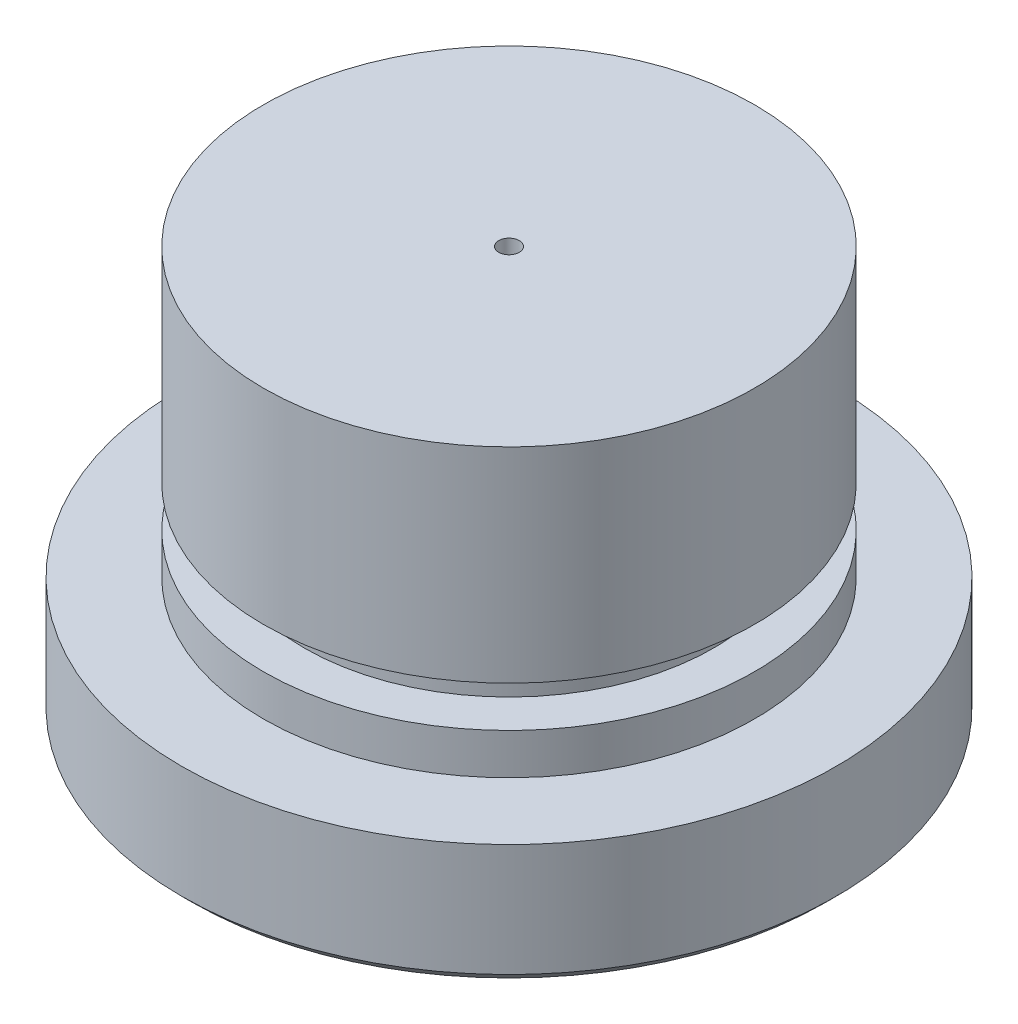
ISO-10303-21;
HEADER;
FILE_DESCRIPTION(('STEP AP214'),'2;1');
FILE_NAME('part.step','',(''),(''),'','','');
FILE_SCHEMA(('AUTOMOTIVE_DESIGN { 1 0 10303 214 1 1 1 1 }'));
ENDSEC;
DATA;
#1=APPLICATION_CONTEXT('core data for automotive mechanical design processes');
#2=APPLICATION_PROTOCOL_DEFINITION('international standard','automotive_design',2000,#1);
#3=PRODUCT_CONTEXT('',#1,'mechanical');
#4=PRODUCT('Part','Part','',(#3));
#5=PRODUCT_RELATED_PRODUCT_CATEGORY('part','',(#4));
#6=PRODUCT_DEFINITION_FORMATION('','',#4);
#7=PRODUCT_DEFINITION_CONTEXT('part definition',#1,'design');
#8=PRODUCT_DEFINITION('design','',#6,#7);
#9=PRODUCT_DEFINITION_SHAPE('','',#8);
#10=(LENGTH_UNIT() NAMED_UNIT(*) SI_UNIT(.MILLI.,.METRE.));
#11=(NAMED_UNIT(*) PLANE_ANGLE_UNIT() SI_UNIT($,.RADIAN.));
#12=(NAMED_UNIT(*) SI_UNIT($,.STERADIAN.) SOLID_ANGLE_UNIT());
#13=UNCERTAINTY_MEASURE_WITH_UNIT(LENGTH_MEASURE(1.E-05),#10,'distance_accuracy_value','');
#14=(GEOMETRIC_REPRESENTATION_CONTEXT(3) GLOBAL_UNCERTAINTY_ASSIGNED_CONTEXT((#13)) GLOBAL_UNIT_ASSIGNED_CONTEXT((#10,
#11,#12)) REPRESENTATION_CONTEXT('',''));
#15=CARTESIAN_POINT('',(0.,0.,0.));
#16=DIRECTION('',(0.,0.,1.));
#17=DIRECTION('',(1.,0.,0.));
#18=AXIS2_PLACEMENT_3D('',#15,#16,#17);
#19=CARTESIAN_POINT('',(0.,4.7625,0.));
#20=DIRECTION('',(0.,1.,0.));
#21=DIRECTION('',(0.,0.,1.));
#22=AXIS2_PLACEMENT_3D('',#19,#20,#21);
#23=CYLINDRICAL_SURFACE('',#22,9.525);
#24=CARTESIAN_POINT('',(0.,4.7625,0.));
#25=DIRECTION('',(0.,1.,0.));
#26=DIRECTION('',(0.,0.,1.));
#27=AXIS2_PLACEMENT_3D('',#24,#25,#26);
#28=CIRCLE('',#27,9.525);
#29=CARTESIAN_POINT('',(0.,4.7625,9.525));
#30=VERTEX_POINT('',#29);
#31=EDGE_CURVE('E45',#30,#30,#28,.T.);
#32=ORIENTED_EDGE('',*,*,#31,.T.);
#33=EDGE_LOOP('',(#32));
#34=FACE_BOUND('',#33,.T.);
#35=CARTESIAN_POINT('',(0.,6.35,0.));
#36=DIRECTION('',(0.,1.,0.));
#37=DIRECTION('',(0.,0.,1.));
#38=AXIS2_PLACEMENT_3D('',#35,#36,#37);
#39=CIRCLE('',#38,9.525);
#40=CARTESIAN_POINT('',(0.,6.35,9.525));
#41=VERTEX_POINT('',#40);
#42=EDGE_CURVE('E60',#41,#41,#39,.T.);
#43=ORIENTED_EDGE('',*,*,#42,.F.);
#44=EDGE_LOOP('',(#43));
#45=FACE_BOUND('',#44,.T.);
#46=ADVANCED_FACE('F30',(#34,#45),#23,.T.);
#47=CARTESIAN_POINT('',(0.,15.875,0.));
#48=DIRECTION('',(0.,-1.,0.));
#49=DIRECTION('',(0.,0.,-1.));
#50=AXIS2_PLACEMENT_3D('',#47,#48,#49);
#51=CYLINDRICAL_SURFACE('',#50,12.7);
#52=CARTESIAN_POINT('',(0.,0.396874999999998,0.));
#53=DIRECTION('',(0.,1.,0.));
#54=DIRECTION('',(0.,0.,1.));
#55=AXIS2_PLACEMENT_3D('',#52,#53,#54);
#56=CIRCLE('',#55,12.7);
#57=CARTESIAN_POINT('',(0.,0.396874999999998,12.7));
#58=VERTEX_POINT('',#57);
#59=EDGE_CURVE('E37',#58,#58,#56,.T.);
#60=ORIENTED_EDGE('',*,*,#59,.T.);
#61=EDGE_LOOP('',(#60));
#62=FACE_BOUND('',#61,.T.);
#63=CARTESIAN_POINT('',(0.,4.7625,0.));
#64=DIRECTION('',(0.,1.,0.));
#65=DIRECTION('',(0.,0.,1.));
#66=AXIS2_PLACEMENT_3D('',#63,#64,#65);
#67=CIRCLE('',#66,12.7);
#68=CARTESIAN_POINT('',(0.,4.7625,12.7));
#69=VERTEX_POINT('',#68);
#70=EDGE_CURVE('E41',#69,#69,#67,.T.);
#71=ORIENTED_EDGE('',*,*,#70,.F.);
#72=EDGE_LOOP('',(#71));
#73=FACE_BOUND('',#72,.T.);
#74=ADVANCED_FACE('F88',(#62,#73),#51,.T.);
#75=CARTESIAN_POINT('',(0.,0.,0.));
#76=DIRECTION('',(0.,1.,0.));
#77=DIRECTION('',(0.,0.,1.));
#78=AXIS2_PLACEMENT_3D('',#75,#76,#77);
#79=PLANE('',#78);
#80=CARTESIAN_POINT('',(0.,0.,0.));
#81=DIRECTION('',(0.,1.,0.));
#82=DIRECTION('',(0.,0.,1.));
#83=AXIS2_PLACEMENT_3D('',#80,#81,#82);
#84=CIRCLE('',#83,12.303125);
#85=CARTESIAN_POINT('',(0.,0.,12.303125));
#86=VERTEX_POINT('',#85);
#87=EDGE_CURVE('E10',#86,#86,#84,.F.);
#88=ORIENTED_EDGE('',*,*,#87,.T.);
#89=EDGE_LOOP('',(#88));
#90=FACE_BOUND('',#89,.T.);
#91=CARTESIAN_POINT('',(0.,0.,0.));
#92=DIRECTION('',(0.,-1.,0.));
#93=DIRECTION('',(0.,0.,-1.));
#94=AXIS2_PLACEMENT_3D('',#91,#92,#93);
#95=CIRCLE('',#94,0.396875);
#96=CARTESIAN_POINT('',(0.,0.,-0.396875));
#97=VERTEX_POINT('',#96);
#98=EDGE_CURVE('E54',#97,#97,#95,.T.);
#99=ORIENTED_EDGE('',*,*,#98,.F.);
#100=EDGE_LOOP('',(#99));
#101=FACE_BOUND('',#100,.T.);
#102=ADVANCED_FACE('F95',(#90,#101),#79,.F.);
#103=CARTESIAN_POINT('',(0.,7.9375,0.));
#104=DIRECTION('',(0.,1.,0.));
#105=DIRECTION('',(0.,0.,1.));
#106=AXIS2_PLACEMENT_3D('',#103,#104,#105);
#107=CIRCLE('',#106,9.525);
#108=CARTESIAN_POINT('',(0.,7.9375,9.525));
#109=VERTEX_POINT('',#108);
#110=EDGE_CURVE('E57',#109,#109,#107,.T.);
#111=ORIENTED_EDGE('',*,*,#110,.T.);
#112=EDGE_LOOP('',(#111));
#113=FACE_BOUND('',#112,.T.);
#114=CARTESIAN_POINT('',(0.,15.875,0.));
#115=DIRECTION('',(0.,1.,0.));
#116=DIRECTION('',(0.,0.,1.));
#117=AXIS2_PLACEMENT_3D('',#114,#115,#116);
#118=CIRCLE('',#117,9.525);
#119=CARTESIAN_POINT('',(0.,15.875,9.525));
#120=VERTEX_POINT('',#119);
#121=EDGE_CURVE('E48',#120,#120,#118,.T.);
#122=ORIENTED_EDGE('',*,*,#121,.F.);
#123=EDGE_LOOP('',(#122));
#124=FACE_BOUND('',#123,.T.);
#125=ADVANCED_FACE('F91',(#113,#124),#23,.T.);
#126=CARTESIAN_POINT('',(0.,4.7625,0.));
#127=DIRECTION('',(0.,1.,0.));
#128=DIRECTION('',(0.,0.,1.));
#129=AXIS2_PLACEMENT_3D('',#126,#127,#128);
#130=PLANE('',#129);
#131=ORIENTED_EDGE('',*,*,#31,.F.);
#132=EDGE_LOOP('',(#131));
#133=FACE_BOUND('',#132,.T.);
#134=ORIENTED_EDGE('',*,*,#70,.T.);
#135=EDGE_LOOP('',(#134));
#136=FACE_BOUND('',#135,.T.);
#137=ADVANCED_FACE('F99',(#133,#136),#130,.T.);
#138=CARTESIAN_POINT('',(0.,15.875,0.));
#139=DIRECTION('',(0.,1.,0.));
#140=DIRECTION('',(0.,0.,1.));
#141=AXIS2_PLACEMENT_3D('',#138,#139,#140);
#142=PLANE('',#141);
#143=CARTESIAN_POINT('',(0.,15.875,0.));
#144=DIRECTION('',(0.,-1.,0.));
#145=DIRECTION('',(0.,0.,-1.));
#146=AXIS2_PLACEMENT_3D('',#143,#144,#145);
#147=CIRCLE('',#146,0.396875);
#148=CARTESIAN_POINT('',(0.,15.875,-0.396875));
#149=VERTEX_POINT('',#148);
#150=EDGE_CURVE('E50',#149,#149,#147,.T.);
#151=ORIENTED_EDGE('',*,*,#150,.T.);
#152=EDGE_LOOP('',(#151));
#153=FACE_BOUND('',#152,.T.);
#154=ORIENTED_EDGE('',*,*,#121,.T.);
#155=EDGE_LOOP('',(#154));
#156=FACE_BOUND('',#155,.T.);
#157=ADVANCED_FACE('F105',(#153,#156),#142,.T.);
#158=CARTESIAN_POINT('',(0.,15.875,0.));
#159=DIRECTION('',(0.,-1.,0.));
#160=DIRECTION('',(0.,0.,-1.));
#161=AXIS2_PLACEMENT_3D('',#158,#159,#160);
#162=CYLINDRICAL_SURFACE('',#161,0.396875);
#163=ORIENTED_EDGE('',*,*,#150,.F.);
#164=EDGE_LOOP('',(#163));
#165=FACE_BOUND('',#164,.T.);
#166=ORIENTED_EDGE('',*,*,#98,.T.);
#167=EDGE_LOOP('',(#166));
#168=FACE_BOUND('',#167,.T.);
#169=ADVANCED_FACE('F113',(#165,#168),#162,.F.);
#170=CARTESIAN_POINT('',(0.,0.396874999999998,0.));
#171=DIRECTION('',(0.,1.,0.));
#172=DIRECTION('',(0.,0.,1.));
#173=AXIS2_PLACEMENT_3D('',#170,#171,#172);
#174=CONICAL_SURFACE('',#173,12.7,0.785398163397448);
#175=ORIENTED_EDGE('',*,*,#87,.F.);
#176=EDGE_LOOP('',(#175));
#177=FACE_BOUND('',#176,.T.);
#178=ORIENTED_EDGE('',*,*,#59,.F.);
#179=EDGE_LOOP('',(#178));
#180=FACE_BOUND('',#179,.T.);
#181=ADVANCED_FACE('F32',(#177,#180),#174,.T.);
#182=CARTESIAN_POINT('',(0.,7.9375,0.));
#183=DIRECTION('',(0.,-1.,0.));
#184=DIRECTION('',(0.,0.,-1.));
#185=AXIS2_PLACEMENT_3D('',#182,#183,#184);
#186=CYLINDRICAL_SURFACE('',#185,7.9375);
#187=CARTESIAN_POINT('',(0.,7.9375,0.));
#188=DIRECTION('',(0.,1.,0.));
#189=DIRECTION('',(0.,0.,1.));
#190=AXIS2_PLACEMENT_3D('',#187,#188,#189);
#191=CIRCLE('',#190,7.9375);
#192=CARTESIAN_POINT('',(0.,7.9375,7.9375));
#193=VERTEX_POINT('',#192);
#194=EDGE_CURVE('E63',#193,#193,#191,.T.);
#195=ORIENTED_EDGE('',*,*,#194,.F.);
#196=EDGE_LOOP('',(#195));
#197=FACE_BOUND('',#196,.T.);
#198=CARTESIAN_POINT('',(0.,6.35,0.));
#199=DIRECTION('',(0.,1.,0.));
#200=DIRECTION('',(0.,0.,1.));
#201=AXIS2_PLACEMENT_3D('',#198,#199,#200);
#202=CIRCLE('',#201,7.9375);
#203=CARTESIAN_POINT('',(0.,6.35,7.9375));
#204=VERTEX_POINT('',#203);
#205=EDGE_CURVE('E64',#204,#204,#202,.T.);
#206=ORIENTED_EDGE('',*,*,#205,.T.);
#207=EDGE_LOOP('',(#206));
#208=FACE_BOUND('',#207,.T.);
#209=ADVANCED_FACE('F75',(#197,#208),#186,.T.);
#210=CARTESIAN_POINT('',(0.,7.9375,0.));
#211=DIRECTION('',(0.,1.,0.));
#212=DIRECTION('',(0.,0.,1.));
#213=AXIS2_PLACEMENT_3D('',#210,#211,#212);
#214=PLANE('',#213);
#215=ORIENTED_EDGE('',*,*,#194,.T.);
#216=EDGE_LOOP('',(#215));
#217=FACE_BOUND('',#216,.T.);
#218=ORIENTED_EDGE('',*,*,#110,.F.);
#219=EDGE_LOOP('',(#218));
#220=FACE_BOUND('',#219,.T.);
#221=ADVANCED_FACE('F72',(#217,#220),#214,.F.);
#222=CARTESIAN_POINT('',(0.,6.35,0.));
#223=DIRECTION('',(0.,1.,0.));
#224=DIRECTION('',(0.,0.,1.));
#225=AXIS2_PLACEMENT_3D('',#222,#223,#224);
#226=PLANE('',#225);
#227=ORIENTED_EDGE('',*,*,#205,.F.);
#228=EDGE_LOOP('',(#227));
#229=FACE_BOUND('',#228,.T.);
#230=ORIENTED_EDGE('',*,*,#42,.T.);
#231=EDGE_LOOP('',(#230));
#232=FACE_BOUND('',#231,.T.);
#233=ADVANCED_FACE('F81',(#229,#232),#226,.T.);
#234=CLOSED_SHELL('',(#46,#74,#102,#125,#137,#157,#169,#181,#209,#221,#233));
#235=MANIFOLD_SOLID_BREP('B2',#234);
#236=ADVANCED_BREP_SHAPE_REPRESENTATION('',(#18,#235),#14);
#237=SHAPE_DEFINITION_REPRESENTATION(#9,#236);
ENDSEC;
END-ISO-10303-21;
